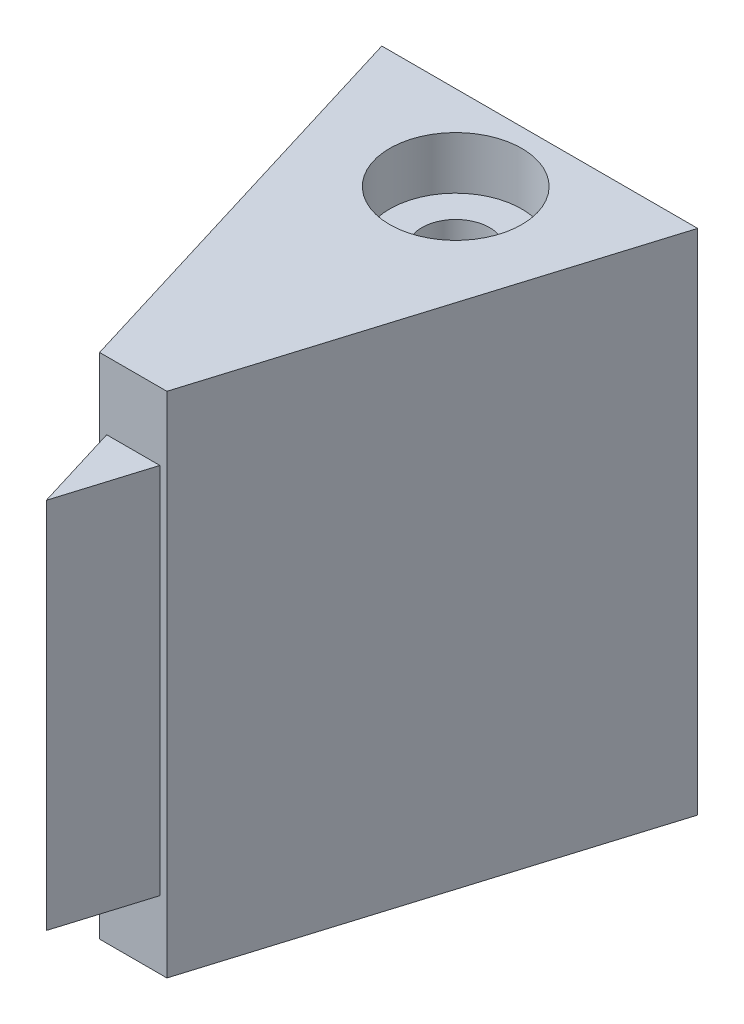
ISO-10303-21;
HEADER;
FILE_DESCRIPTION(('STEP AP214'),'2;1');
FILE_NAME('part.step','',(''),(''),'','','');
FILE_SCHEMA(('AUTOMOTIVE_DESIGN { 1 0 10303 214 1 1 1 1 }'));
ENDSEC;
DATA;
#1=APPLICATION_CONTEXT('core data for automotive mechanical design processes');
#2=APPLICATION_PROTOCOL_DEFINITION('international standard','automotive_design',2000,#1);
#3=PRODUCT_CONTEXT('',#1,'mechanical');
#4=PRODUCT('Part','Part','',(#3));
#5=PRODUCT_RELATED_PRODUCT_CATEGORY('part','',(#4));
#6=PRODUCT_DEFINITION_FORMATION('','',#4);
#7=PRODUCT_DEFINITION_CONTEXT('part definition',#1,'design');
#8=PRODUCT_DEFINITION('design','',#6,#7);
#9=PRODUCT_DEFINITION_SHAPE('','',#8);
#10=(LENGTH_UNIT() NAMED_UNIT(*) SI_UNIT(.MILLI.,.METRE.));
#11=(NAMED_UNIT(*) PLANE_ANGLE_UNIT() SI_UNIT($,.RADIAN.));
#12=(NAMED_UNIT(*) SI_UNIT($,.STERADIAN.) SOLID_ANGLE_UNIT());
#13=UNCERTAINTY_MEASURE_WITH_UNIT(LENGTH_MEASURE(1.E-05),#10,'distance_accuracy_value','');
#14=(GEOMETRIC_REPRESENTATION_CONTEXT(3) GLOBAL_UNCERTAINTY_ASSIGNED_CONTEXT((#13)) GLOBAL_UNIT_ASSIGNED_CONTEXT((#10,
#11,#12)) REPRESENTATION_CONTEXT('',''));
#15=CARTESIAN_POINT('',(0.,0.,0.));
#16=DIRECTION('',(0.,0.,1.));
#17=DIRECTION('',(1.,0.,0.));
#18=AXIS2_PLACEMENT_3D('',#15,#16,#17);
#19=CARTESIAN_POINT('',(-0.0200292878637935,-2.51,19.1313092850622));
#20=DIRECTION('',(0.956304755963033,0.,-0.292371704722745));
#21=DIRECTION('',(-0.292371704722745,0.,-0.956304755963033));
#22=AXIS2_PLACEMENT_3D('',#19,#20,#21);
#23=PLANE('',#22);
#24=DIRECTION('',(0.292371704722745,0.,0.956304755963033));
#25=VECTOR('',#24,1.);
#26=CARTESIAN_POINT('',(-5.36736335318274,-0.5,1.64096765560485));
#27=LINE('',#26,#25);
#28=CARTESIAN_POINT('',(-0.804515651307037,-0.5,16.5653700090289));
#29=VERTEX_POINT('',#28);
#30=CARTESIAN_POINT('',(-0.0200292878637974,-0.5,19.1313092850623));
#31=VERTEX_POINT('',#30);
#32=EDGE_CURVE('E126',#29,#31,#27,.T.);
#33=ORIENTED_EDGE('',*,*,#32,.T.);
#34=DIRECTION('',(0.,1.,0.));
#35=VECTOR('',#34,1.);
#36=CARTESIAN_POINT('',(-0.0200292878637935,-2.51,19.1313092850622));
#37=LINE('',#36,#35);
#38=CARTESIAN_POINT('',(-0.0200292878637948,10.5,19.1313092850622));
#39=VERTEX_POINT('',#38);
#40=EDGE_CURVE('E49',#31,#39,#37,.T.);
#41=ORIENTED_EDGE('',*,*,#40,.T.);
#42=DIRECTION('',(0.292371704722745,0.,0.956304755963033));
#43=VECTOR('',#42,1.);
#44=CARTESIAN_POINT('',(-0.0200292878637948,10.5,19.1313092850622));
#45=LINE('',#44,#43);
#46=CARTESIAN_POINT('',(-0.804515651307037,10.5,16.5653700090289));
#47=VERTEX_POINT('',#46);
#48=EDGE_CURVE('E304',#47,#39,#45,.T.);
#49=ORIENTED_EDGE('',*,*,#48,.F.);
#50=DIRECTION('',(0.,1.,0.));
#51=VECTOR('',#50,1.);
#52=CARTESIAN_POINT('',(-0.804515651307037,-2.51,16.5653700090289));
#53=LINE('',#52,#51);
#54=EDGE_CURVE('E11',#29,#47,#53,.T.);
#55=ORIENTED_EDGE('',*,*,#54,.F.);
#56=EDGE_LOOP('',(#33,#41,#49,#55));
#57=FACE_BOUND('',#56,.T.);
#58=ADVANCED_FACE('F40',(#57),#23,.F.);
#59=CARTESIAN_POINT('',(0.764457075579426,-2.51,16.5653700090289));
#60=DIRECTION('',(-0.956304755963036,0.,-0.292371704722737));
#61=DIRECTION('',(-0.292371704722737,0.,0.956304755963036));
#62=AXIS2_PLACEMENT_3D('',#59,#60,#61);
#63=PLANE('',#62);
#64=DIRECTION('',(0.292371704722738,0.,-0.956304755963035));
#65=VECTOR('',#64,1.);
#66=CARTESIAN_POINT('',(5.33072903312822,-0.5,1.62976741996976));
#67=LINE('',#66,#65);
#68=CARTESIAN_POINT('',(0.764457075579427,-0.5,16.5653700090289));
#69=VERTEX_POINT('',#68);
#70=EDGE_CURVE('E123',#31,#69,#67,.T.);
#71=ORIENTED_EDGE('',*,*,#70,.T.);
#72=DIRECTION('',(0.,1.,0.));
#73=VECTOR('',#72,1.);
#74=CARTESIAN_POINT('',(0.764457075579426,-2.51,16.5653700090289));
#75=LINE('',#74,#73);
#76=CARTESIAN_POINT('',(0.764457075579427,10.5,16.5653700090289));
#77=VERTEX_POINT('',#76);
#78=EDGE_CURVE('E141',#69,#77,#75,.T.);
#79=ORIENTED_EDGE('',*,*,#78,.T.);
#80=DIRECTION('',(0.292371704722738,0.,-0.956304755963035));
#81=VECTOR('',#80,1.);
#82=CARTESIAN_POINT('',(0.764457075579427,10.5,16.5653700090289));
#83=LINE('',#82,#81);
#84=EDGE_CURVE('E140',#39,#77,#83,.T.);
#85=ORIENTED_EDGE('',*,*,#84,.F.);
#86=ORIENTED_EDGE('',*,*,#40,.F.);
#87=EDGE_LOOP('',(#71,#79,#85,#86));
#88=FACE_BOUND('',#87,.T.);
#89=ADVANCED_FACE('F138',(#88),#63,.F.);
#90=CARTESIAN_POINT('',(0.,-2.5,0.));
#91=DIRECTION('',(0.,1.,0.));
#92=DIRECTION('',(0.,0.,1.));
#93=AXIS2_PLACEMENT_3D('',#90,#91,#92);
#94=PLANE('',#93);
#95=CARTESIAN_POINT('',(0.,-2.5,7.06537000902889));
#96=DIRECTION('',(0.,1.,0.));
#97=DIRECTION('',(0.,0.,1.));
#98=AXIS2_PLACEMENT_3D('',#95,#96,#97);
#99=CIRCLE('',#98,0.999999999999795);
#100=CARTESIAN_POINT('',(0.,-2.5,8.06537000902868));
#101=VERTEX_POINT('',#100);
#102=EDGE_CURVE('E152',#101,#101,#99,.T.);
#103=ORIENTED_EDGE('',*,*,#102,.T.);
#104=EDGE_LOOP('',(#103));
#105=FACE_BOUND('',#104,.T.);
#106=DIRECTION('',(0.292371704722737,0.,-0.956304755963035));
#107=VECTOR('',#106,1.);
#108=CARTESIAN_POINT('',(0.973595426876858,-2.5,16.5653700090289));
#109=LINE('',#108,#107);
#110=CARTESIAN_POINT('',(0.973595426876858,-2.5,16.5653700090289));
#111=VERTEX_POINT('',#110);
#112=CARTESIAN_POINT('',(4.64236360438078,-2.5,4.56537000902889));
#113=VERTEX_POINT('',#112);
#114=EDGE_CURVE('E166',#111,#113,#109,.T.);
#115=ORIENTED_EDGE('',*,*,#114,.F.);
#116=DIRECTION('',(-1.,0.,0.));
#117=VECTOR('',#116,1.);
#118=CARTESIAN_POINT('',(0.,-2.5,16.5653700090289));
#119=LINE('',#118,#117);
#120=CARTESIAN_POINT('',(-1.01365400260447,-2.5,16.5653700090289));
#121=VERTEX_POINT('',#120);
#122=EDGE_CURVE('E44',#111,#121,#119,.T.);
#123=ORIENTED_EDGE('',*,*,#122,.T.);
#124=DIRECTION('',(0.292371704722747,0.,0.956304755963032));
#125=VECTOR('',#124,1.);
#126=CARTESIAN_POINT('',(-0.0200292878637907,-2.5,19.8153700090289));
#127=LINE('',#126,#125);
#128=CARTESIAN_POINT('',(-4.68242218010851,-2.5,4.56537000902889));
#129=VERTEX_POINT('',#128);
#130=EDGE_CURVE('E168',#129,#121,#127,.T.);
#131=ORIENTED_EDGE('',*,*,#130,.F.);
#132=DIRECTION('',(-1.,0.,0.));
#133=VECTOR('',#132,1.);
#134=CARTESIAN_POINT('',(4.64236360438078,-2.5,4.56537000902889));
#135=LINE('',#134,#133);
#136=EDGE_CURVE('E162',#113,#129,#135,.T.);
#137=ORIENTED_EDGE('',*,*,#136,.F.);
#138=EDGE_LOOP('',(#115,#123,#131,#137));
#139=FACE_BOUND('',#138,.T.);
#140=ADVANCED_FACE('F272',(#105,#139),#94,.F.);
#141=CARTESIAN_POINT('',(0.973595426876855,-2.51,16.5653700090289));
#142=DIRECTION('',(0.,0.,-1.));
#143=DIRECTION('',(-1.,0.,0.));
#144=AXIS2_PLACEMENT_3D('',#141,#142,#143);
#145=PLANE('',#144);
#146=DIRECTION('',(-1.,0.,0.));
#147=VECTOR('',#146,1.);
#148=CARTESIAN_POINT('',(0.,-0.5,16.5653700090289));
#149=LINE('',#148,#147);
#150=EDGE_CURVE('E128',#69,#29,#149,.T.);
#151=ORIENTED_EDGE('',*,*,#150,.T.);
#152=ORIENTED_EDGE('',*,*,#54,.T.);
#153=DIRECTION('',(-1.,0.,0.));
#154=VECTOR('',#153,1.);
#155=CARTESIAN_POINT('',(-0.804515651307037,10.5,16.5653700090289));
#156=LINE('',#155,#154);
#157=EDGE_CURVE('E297',#77,#47,#156,.T.);
#158=ORIENTED_EDGE('',*,*,#157,.F.);
#159=ORIENTED_EDGE('',*,*,#78,.F.);
#160=EDGE_LOOP('',(#151,#152,#158,#159));
#161=FACE_BOUND('',#160,.T.);
#162=DIRECTION('',(0.,1.,0.));
#163=VECTOR('',#162,1.);
#164=CARTESIAN_POINT('',(0.973595426876858,-2.5,16.5653700090289));
#165=LINE('',#164,#163);
#166=CARTESIAN_POINT('',(0.973595426876858,12.5,16.5653700090289));
#167=VERTEX_POINT('',#166);
#168=EDGE_CURVE('E146',#111,#167,#165,.T.);
#169=ORIENTED_EDGE('',*,*,#168,.T.);
#170=DIRECTION('',(-1.,0.,0.));
#171=VECTOR('',#170,1.);
#172=CARTESIAN_POINT('',(0.,12.5,16.5653700090289));
#173=LINE('',#172,#171);
#174=CARTESIAN_POINT('',(-1.01365400260447,12.5,16.5653700090289));
#175=VERTEX_POINT('',#174);
#176=EDGE_CURVE('E57',#167,#175,#173,.T.);
#177=ORIENTED_EDGE('',*,*,#176,.T.);
#178=DIRECTION('',(0.,-1.,0.));
#179=VECTOR('',#178,1.);
#180=CARTESIAN_POINT('',(-1.01365400260447,-2.5,16.5653700090289));
#181=LINE('',#180,#179);
#182=EDGE_CURVE('E144',#175,#121,#181,.T.);
#183=ORIENTED_EDGE('',*,*,#182,.T.);
#184=ORIENTED_EDGE('',*,*,#122,.F.);
#185=EDGE_LOOP('',(#169,#177,#183,#184));
#186=FACE_BOUND('',#185,.T.);
#187=ADVANCED_FACE('F42',(#161,#186),#145,.F.);
#188=CARTESIAN_POINT('',(-0.0200292878638651,5.,9.56537000902889));
#189=DIRECTION('',(0.,0.,-1.));
#190=DIRECTION('',(-1.,0.,0.));
#191=AXIS2_PLACEMENT_3D('',#188,#189,#190);
#192=PLANE('',#191);
#193=CARTESIAN_POINT('',(-0.0200292878638651,5.,9.56537000902889));
#194=DIRECTION('',(0.,0.,-1.));
#195=DIRECTION('',(-1.,0.,0.));
#196=AXIS2_PLACEMENT_3D('',#193,#194,#195);
#197=CIRCLE('',#196,3.05);
#198=CARTESIAN_POINT('',(2.87824606137402,4.05,9.56537000902889));
#199=VERTEX_POINT('',#198);
#200=CARTESIAN_POINT('',(-2.91830463710175,4.05,9.56537000902889));
#201=VERTEX_POINT('',#200);
#202=EDGE_CURVE('E187',#199,#201,#197,.T.);
#203=ORIENTED_EDGE('',*,*,#202,.T.);
#204=DIRECTION('',(1.,0.,0.));
#205=VECTOR('',#204,1.);
#206=CARTESIAN_POINT('',(2.87824606137402,4.05,9.56537000902889));
#207=LINE('',#206,#205);
#208=EDGE_CURVE('E182',#201,#199,#207,.T.);
#209=ORIENTED_EDGE('',*,*,#208,.T.);
#210=EDGE_LOOP('',(#203,#209));
#211=FACE_BOUND('',#210,.T.);
#212=ADVANCED_FACE('F252',(#211),#192,.T.);
#213=CARTESIAN_POINT('',(0.,-2.5,7.06537000902889));
#214=DIRECTION('',(0.,1.,0.));
#215=DIRECTION('',(0.,0.,1.));
#216=AXIS2_PLACEMENT_3D('',#213,#214,#215);
#217=CYLINDRICAL_SURFACE('',#216,0.999999999999795);
#218=CARTESIAN_POINT('',(0.,5.95,7.06537000902889));
#219=DIRECTION('',(0.,-1.,0.));
#220=DIRECTION('',(0.,0.,-1.));
#221=AXIS2_PLACEMENT_3D('',#218,#219,#220);
#222=CIRCLE('',#221,0.999999999999795);
#223=CARTESIAN_POINT('',(0.,5.95,6.06537000902909));
#224=VERTEX_POINT('',#223);
#225=EDGE_CURVE('E154',#224,#224,#222,.T.);
#226=ORIENTED_EDGE('',*,*,#225,.F.);
#227=EDGE_LOOP('',(#226));
#228=FACE_BOUND('',#227,.T.);
#229=CARTESIAN_POINT('',(0.,4.05,7.06537000902889));
#230=DIRECTION('',(0.,1.,0.));
#231=DIRECTION('',(0.,0.,1.));
#232=AXIS2_PLACEMENT_3D('',#229,#230,#231);
#233=CIRCLE('',#232,0.999999999999795);
#234=CARTESIAN_POINT('',(0.,4.05,8.06537000902868));
#235=VERTEX_POINT('',#234);
#236=EDGE_CURVE('E218',#235,#235,#233,.T.);
#237=ORIENTED_EDGE('',*,*,#236,.F.);
#238=EDGE_LOOP('',(#237));
#239=FACE_BOUND('',#238,.T.);
#240=ADVANCED_FACE('F233',(#228,#239),#217,.F.);
#241=CARTESIAN_POINT('',(-0.0200292878638651,5.,9.56537000902889));
#242=DIRECTION('',(0.,0.,-1.));
#243=DIRECTION('',(-1.,0.,0.));
#244=AXIS2_PLACEMENT_3D('',#241,#242,#243);
#245=PLANE('',#244);
#246=CARTESIAN_POINT('',(-0.0200292878638651,5.,9.56537000902889));
#247=DIRECTION('',(0.,0.,-1.));
#248=DIRECTION('',(-1.,0.,0.));
#249=AXIS2_PLACEMENT_3D('',#246,#247,#248);
#250=CIRCLE('',#249,3.05);
#251=CARTESIAN_POINT('',(-2.91830463710175,5.95,9.56537000902889));
#252=VERTEX_POINT('',#251);
#253=CARTESIAN_POINT('',(2.87824606137402,5.95,9.56537000902889));
#254=VERTEX_POINT('',#253);
#255=EDGE_CURVE('E203',#252,#254,#250,.T.);
#256=ORIENTED_EDGE('',*,*,#255,.T.);
#257=DIRECTION('',(-1.,0.,0.));
#258=VECTOR('',#257,1.);
#259=CARTESIAN_POINT('',(2.87824606137402,5.95,9.56537000902889));
#260=LINE('',#259,#258);
#261=EDGE_CURVE('E198',#254,#252,#260,.T.);
#262=ORIENTED_EDGE('',*,*,#261,.T.);
#263=EDGE_LOOP('',(#256,#262));
#264=FACE_BOUND('',#263,.T.);
#265=ADVANCED_FACE('F236',(#264),#245,.T.);
#266=CARTESIAN_POINT('',(0.,8.04993423332826,8.06537000902868));
#267=CARTESIAN_POINT('',(0.0546821791008591,8.04957510796066,8.06537003134291));
#268=CARTESIAN_POINT('',(0.109354914126314,8.04773172784493,8.0608700796451));
#269=CARTESIAN_POINT('',(0.217072928600975,8.04124911512673,8.0430513451388));
#270=CARTESIAN_POINT('',(0.270117951898954,8.03660944482241,8.02973118167488));
#271=CARTESIAN_POINT('',(0.373013096085542,8.02501178523379,7.9947834956713));
#272=CARTESIAN_POINT('',(0.422868473539478,8.01805773388006,7.97317007466059));
#273=CARTESIAN_POINT('',(0.518239677542278,8.00251631313627,7.92231226129294));
#274=CARTESIAN_POINT('',(0.563754694999946,7.99392864011109,7.89306644995588));
#275=CARTESIAN_POINT('',(0.650728756928365,7.97567153728033,7.82670873711478));
#276=CARTESIAN_POINT('',(0.692016888170353,7.96597671144104,7.789379829442));
#277=CARTESIAN_POINT('',(0.767869116779319,7.94673554743408,7.7083762283634));
#278=CARTESIAN_POINT('',(0.802431776578928,7.93718924141278,7.66470018173609));
#279=CARTESIAN_POINT('',(0.864765151781457,7.91902793004534,7.5707826132558));
#280=CARTESIAN_POINT('',(0.892326299349008,7.91044519441132,7.52039518357941));
#281=CARTESIAN_POINT('',(0.938505856826815,7.89556616206647,7.41536260915563));
#282=CARTESIAN_POINT('',(0.957127077871142,7.88926914676962,7.36071880910146));
#283=CARTESIAN_POINT('',(0.984242433141647,7.87995461814357,7.25073786122397));
#284=CARTESIAN_POINT('',(0.993067689027361,7.87683020189835,7.19549165552765));
#285=CARTESIAN_POINT('',(1.00137637507627,7.87389140563375,7.0842210997125));
#286=CARTESIAN_POINT('',(1.00086267310011,7.87407600946129,7.02819699375629));
#287=CARTESIAN_POINT('',(0.99076096088365,7.87764266918273,6.91967266210838));
#288=CARTESIAN_POINT('',(0.981587657973599,7.88087859001705,6.86712821582431));
#289=CARTESIAN_POINT('',(0.955100149434765,7.8899509641507,6.76437204334019));
#290=CARTESIAN_POINT('',(0.937784973426303,7.89578772742408,6.71416059597993));
#291=CARTESIAN_POINT('',(0.895224866547381,7.90952145894585,6.61653210436769));
#292=CARTESIAN_POINT('',(0.869854126003332,7.91745075100137,6.56917464604347));
#293=CARTESIAN_POINT('',(0.811993742784764,7.93447527343163,6.47925869308694));
#294=CARTESIAN_POINT('',(0.779502046774439,7.94357083978839,6.43670158801433));
#295=CARTESIAN_POINT('',(0.706310455681535,7.96250407370069,6.35524458013623));
#296=CARTESIAN_POINT('',(0.665269123333407,7.97235562915799,6.31665408360598));
#297=CARTESIAN_POINT('',(0.57718349640282,7.99129803558887,6.24682351617368));
#298=CARTESIAN_POINT('',(0.530138584475256,8.00038880817212,6.21558420213093));
#299=CARTESIAN_POINT('',(0.430676287465459,8.01694054662288,6.16106484602444));
#300=CARTESIAN_POINT('',(0.378205748438876,8.0243825903494,6.13787563631923));
#301=CARTESIAN_POINT('',(0.269803272333861,8.03668686866806,6.10075330920549));
#302=CARTESIAN_POINT('',(0.213872509814023,8.04154997336318,6.08681706955583));
#303=CARTESIAN_POINT('',(0.102675980012124,8.04801791966975,6.06913107849329));
#304=CARTESIAN_POINT('',(0.0474822649655247,8.04975195790472,6.06497514173016));
#305=CARTESIAN_POINT('',(-0.0628415625782379,8.05019803748363,6.0658238541015));
#306=CARTESIAN_POINT('',(-0.11797168444029,8.04891060250071,6.07082691579136));
#307=CARTESIAN_POINT('',(-0.224905098860222,8.04356865345438,6.0895227717292));
#308=CARTESIAN_POINT('',(-0.27675855569376,8.03959688095123,6.10295488916953));
#309=CARTESIAN_POINT('',(-0.377465816854332,8.02940636298488,6.13781410513821));
#310=CARTESIAN_POINT('',(-0.426319262034692,8.02318734910412,6.15924215873627));
#311=CARTESIAN_POINT('',(-0.520961047176242,8.00897230857037,6.2100604659352));
#312=CARTESIAN_POINT('',(-0.566646489467878,8.0009368899842,6.2396309979426));
#313=CARTESIAN_POINT('',(-0.65254261544519,7.98401517307969,6.30568228657445));
#314=CARTESIAN_POINT('',(-0.692751707956591,7.97512862873551,6.34216504424128));
#315=CARTESIAN_POINT('',(-0.768368832186386,7.9570367257478,6.42287653863802));
#316=CARTESIAN_POINT('',(-0.803492685593696,7.94783427305369,6.46737277538544));
#317=CARTESIAN_POINT('',(-0.865812896971176,7.93056297373217,6.561814306128));
#318=CARTESIAN_POINT('',(-0.893009191170616,7.92249413622404,6.61175964395225));
#319=CARTESIAN_POINT('',(-0.938600028099442,7.908487452095,6.71573217026841));
#320=CARTESIAN_POINT('',(-0.957006080265417,7.90254682148472,6.76975391336835));
#321=CARTESIAN_POINT('',(-0.984385447206509,7.89356679235751,6.88036261430816));
#322=CARTESIAN_POINT('',(-0.993362642639482,7.89052620031194,6.93694850680402));
#323=CARTESIAN_POINT('',(-1.00133163032267,7.88782991758724,7.04818230585044));
#324=CARTESIAN_POINT('',(-1.00077845522218,7.8880199719282,7.10279422493158));
#325=CARTESIAN_POINT('',(-0.990816979227545,7.89138344959095,7.21110590212351));
#326=CARTESIAN_POINT('',(-0.981409159874996,7.89455671067717,7.26480570967594));
#327=CARTESIAN_POINT('',(-0.954326006544325,7.90340934975765,7.36885594585062));
#328=CARTESIAN_POINT('',(-0.936795159679116,7.9090448351629,7.41924801009586));
#329=CARTESIAN_POINT('',(-0.894078597598813,7.92216267155434,7.51641516301269));
#330=CARTESIAN_POINT('',(-0.868891247980455,7.92964541680364,7.56318947674054));
#331=CARTESIAN_POINT('',(-0.810369867509382,7.94598359665686,7.6538685388687));
#332=CARTESIAN_POINT('',(-0.776744477808668,7.95488269367938,7.69757735474066));
#333=CARTESIAN_POINT('',(-0.702796321419838,7.97283954400193,7.77888143930107));
#334=CARTESIAN_POINT('',(-0.662471761379352,7.98189733920272,7.81647506561977));
#335=CARTESIAN_POINT('',(-0.574566833244119,7.99951060425292,7.88580532807814));
#336=CARTESIAN_POINT('',(-0.526781666832324,8.00803733466461,7.91729045245042));
#337=CARTESIAN_POINT('',(-0.42631739774142,8.02324420992155,7.97174481231142));
#338=CARTESIAN_POINT('',(-0.373639825535698,8.02992492966523,7.99471669981805));
#339=CARTESIAN_POINT('',(-0.268082191246842,8.04033135878708,8.03027889077588));
#340=CARTESIAN_POINT('',(-0.215395649662781,8.0442075496374,8.0433995880839));
#341=CARTESIAN_POINT('',(-0.108469393021745,8.04918673358594,8.06094409709436));
#342=CARTESIAN_POINT('',(-0.0542300522364904,8.05029038935139,8.06536998689896));
#343=CARTESIAN_POINT('',(0.,8.04993423332826,8.06537000902868));
#344=B_SPLINE_CURVE_WITH_KNOTS('',3,(#266,#267,#268,#269,#270,#271,#272,#273,#274,#275,#276,
#277,#278,#279,#280,#281,#282,#283,#284,#285,#286,#287,#288,#289,#290,#291,#292,#293,#294,#295,
#296,#297,#298,#299,#300,#301,#302,#303,#304,#305,#306,#307,#308,#309,#310,#311,#312,#313,#314,
#315,#316,#317,#318,#319,#320,#321,#322,#323,#324,#325,#326,#327,#328,#329,#330,#331,#332,#333,
#334,#335,#336,#337,#338,#339,#340,#341,#342,#343),.UNSPECIFIED.,.T.,.F.,(4,2,2,2,2,2,2,2,2,2,2,
2,2,2,2,2,2,2,2,2,2,2,2,2,2,2,2,2,2,2,2,2,2,2,2,2,2,2,4),(0.,0.163850025249576,
0.327725704522648,0.491323962064708,0.654952656763252,0.823688007705309,0.992459386251062,
1.16580686426493,1.33909979790541,1.50633759959778,1.67352404581624,1.83308952664912,
1.99267402993055,2.15488479838887,2.31714240219587,2.48792062945066,2.65871643191758,
2.83138111770078,3.00398751137513,3.16928819199399,3.33456022528501,3.49495717905625,
3.65537329747941,3.81967478229688,3.98402390415546,4.15550728499603,4.32699204524211,
4.49825165341348,4.66944074819149,4.83247997411711,4.99551033400225,5.15574601024891,
5.31601591541804,5.48284858292629,5.64972598333098,5.8224532304353,5.99512662474744,
6.15766074540814,6.32015601487876),.UNSPECIFIED.);
#345=CARTESIAN_POINT('',(0.,8.04993423332826,8.06537000902868));
#346=VERTEX_POINT('',#345);
#347=EDGE_CURVE('E157',#346,#346,#344,.T.);
#348=ORIENTED_EDGE('',*,*,#347,.F.);
#349=EDGE_LOOP('',(#348));
#350=FACE_BOUND('',#349,.T.);
#351=CARTESIAN_POINT('',(0.,10.95,7.06537000902889));
#352=DIRECTION('',(0.,1.,0.));
#353=DIRECTION('',(0.,0.,1.));
#354=AXIS2_PLACEMENT_3D('',#351,#352,#353);
#355=CIRCLE('',#354,0.999999999999795);
#356=CARTESIAN_POINT('',(0.,10.95,8.06537000902868));
#357=VERTEX_POINT('',#356);
#358=EDGE_CURVE('E149',#357,#357,#355,.F.);
#359=ORIENTED_EDGE('',*,*,#358,.F.);
#360=EDGE_LOOP('',(#359));
#361=FACE_BOUND('',#360,.T.);
#362=ADVANCED_FACE('F232',(#350,#361),#217,.F.);
#363=CARTESIAN_POINT('',(0.,10.95,7.06537000902889));
#364=DIRECTION('',(0.,1.,0.));
#365=DIRECTION('',(0.,0.,1.));
#366=AXIS2_PLACEMENT_3D('',#363,#364,#365);
#367=PLANE('',#366);
#368=CARTESIAN_POINT('',(0.,10.95,7.06537000902889));
#369=DIRECTION('',(0.,1.,0.));
#370=DIRECTION('',(0.,0.,1.));
#371=AXIS2_PLACEMENT_3D('',#368,#369,#370);
#372=CIRCLE('',#371,1.95);
#373=CARTESIAN_POINT('',(0.,10.95,9.01537000902889));
#374=VERTEX_POINT('',#373);
#375=EDGE_CURVE('E153',#374,#374,#372,.T.);
#376=ORIENTED_EDGE('',*,*,#375,.T.);
#377=EDGE_LOOP('',(#376));
#378=FACE_BOUND('',#377,.T.);
#379=ORIENTED_EDGE('',*,*,#358,.T.);
#380=EDGE_LOOP('',(#379));
#381=FACE_BOUND('',#380,.T.);
#382=ADVANCED_FACE('F257',(#378,#381),#367,.T.);
#383=CARTESIAN_POINT('',(2.87824606137402,4.05,9.56537000902889));
#384=DIRECTION('',(0.,1.,0.));
#385=DIRECTION('',(0.,0.,1.));
#386=AXIS2_PLACEMENT_3D('',#383,#384,#385);
#387=PLANE('',#386);
#388=ORIENTED_EDGE('',*,*,#236,.T.);
#389=EDGE_LOOP('',(#388));
#390=FACE_BOUND('',#389,.T.);
#391=DIRECTION('',(1.,0.,0.));
#392=VECTOR('',#391,1.);
#393=CARTESIAN_POINT('',(2.87824606137402,4.05,4.56537000902889));
#394=LINE('',#393,#392);
#395=CARTESIAN_POINT('',(-2.91830463710175,4.05,4.56537000902889));
#396=VERTEX_POINT('',#395);
#397=CARTESIAN_POINT('',(2.87824606137402,4.05,4.56537000902889));
#398=VERTEX_POINT('',#397);
#399=EDGE_CURVE('E184',#396,#398,#394,.T.);
#400=ORIENTED_EDGE('',*,*,#399,.T.);
#401=DIRECTION('',(0.,0.,-1.));
#402=VECTOR('',#401,1.);
#403=CARTESIAN_POINT('',(2.87824606137402,4.05,9.56537000902889));
#404=LINE('',#403,#402);
#405=EDGE_CURVE('E178',#199,#398,#404,.T.);
#406=ORIENTED_EDGE('',*,*,#405,.F.);
#407=ORIENTED_EDGE('',*,*,#208,.F.);
#408=DIRECTION('',(0.,0.,-1.));
#409=VECTOR('',#408,1.);
#410=CARTESIAN_POINT('',(-2.91830463710175,4.05,9.56537000902889));
#411=LINE('',#410,#409);
#412=EDGE_CURVE('E179',#201,#396,#411,.T.);
#413=ORIENTED_EDGE('',*,*,#412,.T.);
#414=EDGE_LOOP('',(#400,#406,#407,#413));
#415=FACE_BOUND('',#414,.T.);
#416=ADVANCED_FACE('F255',(#390,#415),#387,.F.);
#417=CARTESIAN_POINT('',(-0.0200292878638651,5.,9.56537000902889));
#418=DIRECTION('',(0.,0.,-1.));
#419=DIRECTION('',(-1.,0.,0.));
#420=AXIS2_PLACEMENT_3D('',#417,#418,#419);
#421=CYLINDRICAL_SURFACE('',#420,3.05);
#422=CARTESIAN_POINT('',(0.,1.95006576667174,8.06537000902868));
#423=CARTESIAN_POINT('',(-0.0545467083170213,1.94970747285087,8.06537014842768));
#424=CARTESIAN_POINT('',(-0.109102594425875,1.95082617973328,8.0608924995377));
#425=CARTESIAN_POINT('',(-0.216630559947825,1.95586683343102,8.04314372343465));
#426=CARTESIAN_POINT('',(-0.269602455019722,1.95978910520613,8.02987157686885));
#427=CARTESIAN_POINT('',(-0.372395540865111,1.96998281568037,7.9950275098491));
#428=CARTESIAN_POINT('',(-0.422221565195225,1.97625054265354,7.973468701733));
#429=CARTESIAN_POINT('',(-0.517558158763021,1.99046661490332,7.92272142069787));
#430=CARTESIAN_POINT('',(-0.563067913976883,1.9984152762853,7.89353151248061));
#431=CARTESIAN_POINT('',(-0.649966255197754,2.0154231807719,7.82735020137387));
#432=CARTESIAN_POINT('',(-0.691194169171496,2.02450822082243,7.79015451043477));
#433=CARTESIAN_POINT('',(-0.766956256715783,2.04261595831002,7.7094526800914));
#434=CARTESIAN_POINT('',(-0.801489039696813,2.05163864242117,7.66594523299885));
#435=CARTESIAN_POINT('',(-0.863833114798163,2.06886144062743,7.57236170710818));
#436=CARTESIAN_POINT('',(-0.891427757355958,2.07703123807653,7.5221351619421));
#437=CARTESIAN_POINT('',(-0.937715224095409,2.09122999962885,7.41745339240553));
#438=CARTESIAN_POINT('',(-0.956410489644233,2.09725955075052,7.36299933254285));
#439=CARTESIAN_POINT('',(-0.98378774157987,2.10623552314352,7.25316209699885));
#440=CARTESIAN_POINT('',(-0.992758921547917,2.10927073194073,7.19785848159756));
#441=CARTESIAN_POINT('',(-1.00133622536939,2.1121705310223,7.08645414512163));
#442=CARTESIAN_POINT('',(-1.00094504098822,2.11203603262665,7.03035365779079));
#443=CARTESIAN_POINT('',(-0.991038308718468,2.10869152283109,6.92147912268892));
#444=CARTESIAN_POINT('',(-0.981911130689609,2.10561242249054,6.86866501351363));
#445=CARTESIAN_POINT('',(-0.955426185023448,2.09694560803578,6.76536168143749));
#446=CARTESIAN_POINT('',(-0.938067486579282,2.09135761022334,6.71487272216934));
#447=CARTESIAN_POINT('',(-0.895355477528405,2.07821837470153,6.6167672431692));
#448=CARTESIAN_POINT('',(-0.869886126954097,2.07063893932841,6.5692051855977));
#449=CARTESIAN_POINT('',(-0.811753224255465,2.05439616233121,6.47890419675966));
#450=CARTESIAN_POINT('',(-0.779087700884409,2.04573252399295,6.43616659191586));
#451=CARTESIAN_POINT('',(-0.705621370189618,2.02780243830253,6.35455640683283));
#452=CARTESIAN_POINT('',(-0.664503649472307,2.01852709526581,6.31597050530051));
#453=CARTESIAN_POINT('',(-0.57625917050636,2.00081162712214,6.24616898216816));
#454=CARTESIAN_POINT('',(-0.529131951252226,1.99237156618035,6.21495392653086));
#455=CARTESIAN_POINT('',(-0.42967631027486,1.97721392807559,6.16059752963539));
#456=CARTESIAN_POINT('',(-0.377310405391615,1.97051020892516,6.13752064297751));
#457=CARTESIAN_POINT('',(-0.269171299120882,1.9597079998363,6.10058591678685));
#458=CARTESIAN_POINT('',(-0.213399241292621,1.95560864074058,6.08672500152104));
#459=CARTESIAN_POINT('',(-0.10253908456766,1.95063259271298,6.06912548318687));
#460=CARTESIAN_POINT('',(-0.0475199824239522,1.94962825812152,6.06498767267624));
#461=CARTESIAN_POINT('',(0.0624178408306011,1.95061930503421,6.06580783262257));
#462=CARTESIAN_POINT('',(0.117336575934049,1.95261423039507,6.07076441998072));
#463=CARTESIAN_POINT('',(0.224019697915292,1.95932166494474,6.08932142334608));
#464=CARTESIAN_POINT('',(0.275829029613629,1.96396161104079,6.10269199072763));
#465=CARTESIAN_POINT('',(0.376441018754687,1.97545416982598,6.1374016340776));
#466=CARTESIAN_POINT('',(0.425243272951458,1.98230707850544,6.15874177606015));
#467=CARTESIAN_POINT('',(0.519942958677845,1.99778474493448,6.20943615236094));
#468=CARTESIAN_POINT('',(0.565724086676077,2.00645292462781,6.23899404054972));
#469=CARTESIAN_POINT('',(0.65180500165392,2.02458793082162,6.30504407730197));
#470=CARTESIAN_POINT('',(0.692103118494657,2.03405499924922,6.34153833062207));
#471=CARTESIAN_POINT('',(0.767932225486806,2.05327037108428,6.42234306540777));
#472=CARTESIAN_POINT('',(0.803172677487142,2.06301253612594,6.46692833440378));
#473=CARTESIAN_POINT('',(0.865699423276716,2.08125899142385,6.5616021249502));
#474=CARTESIAN_POINT('',(0.892985766856479,2.08976328942864,6.61169061204926));
#475=CARTESIAN_POINT('',(0.938651779165637,2.10448494111707,6.71586576519746));
#476=CARTESIAN_POINT('',(0.957065998669795,2.11071114322027,6.76993596046547));
#477=CARTESIAN_POINT('',(0.984445615434366,2.12011390689645,6.88066589489971));
#478=CARTESIAN_POINT('',(0.993415282022461,2.12329184635206,6.93732445192374));
#479=CARTESIAN_POINT('',(1.00132679388868,2.12609197133263,7.04845788777591));
#480=CARTESIAN_POINT('',(1.00076507768828,2.12589019545742,7.10289342027352));
#481=CARTESIAN_POINT('',(0.990844746741187,2.12238627741313,7.21085016959212));
#482=CARTESIAN_POINT('',(0.981486635847406,2.11908431282127,7.26437143860285));
#483=CARTESIAN_POINT('',(0.954582416471499,2.1098742046831,7.36800345557402));
#484=CARTESIAN_POINT('',(0.937190144831295,2.10401513574912,7.41815883854906));
#485=CARTESIAN_POINT('',(0.894835988822796,2.090358382842,7.51487803621554));
#486=CARTESIAN_POINT('',(0.869872431323104,2.08256027044038,7.56144105419678));
#487=CARTESIAN_POINT('',(0.811804845722808,2.06546338643234,7.65187315687851));
#488=CARTESIAN_POINT('',(0.778391036585527,2.05611369258926,7.69553364274029));
#489=CARTESIAN_POINT('',(0.704904242322278,2.03716191630836,7.77678571189248));
#490=CARTESIAN_POINT('',(0.664829330890099,2.02755976154021,7.81437553340602));
#491=CARTESIAN_POINT('',(0.577262492650444,2.0087087644859,7.88391432033876));
#492=CARTESIAN_POINT('',(0.529540250451134,1.99948882586492,7.91558208528871));
#493=CARTESIAN_POINT('',(0.42915302715261,1.98282933317401,7.97040925400301));
#494=CARTESIAN_POINT('',(0.376489408870778,1.97538929021161,7.99357099509525));
#495=CARTESIAN_POINT('',(0.270526055479718,1.96342787080536,8.02962243255354));
#496=CARTESIAN_POINT('',(0.21740168051063,1.95877488381879,8.04298349104672));
#497=CARTESIAN_POINT('',(0.109520989825704,1.95227407622703,8.06085600970638));
#498=CARTESIAN_POINT('',(0.0547651206314484,1.95042549514897,8.06536986907151));
#499=CARTESIAN_POINT('',(0.,1.95006576667174,8.06537000902868));
#500=B_SPLINE_CURVE_WITH_KNOTS('',3,(#422,#423,#424,#425,#426,#427,#428,#429,#430,#431,#432,
#433,#434,#435,#436,#437,#438,#439,#440,#441,#442,#443,#444,#445,#446,#447,#448,#449,#450,#451,
#452,#453,#454,#455,#456,#457,#458,#459,#460,#461,#462,#463,#464,#465,#466,#467,#468,#469,#470,
#471,#472,#473,#474,#475,#476,#477,#478,#479,#480,#481,#482,#483,#484,#485,#486,#487,#488,#489,
#490,#491,#492,#493,#494,#495,#496,#497,#498,#499),.UNSPECIFIED.,.T.,.F.,(4,2,2,2,2,2,2,2,2,2,2,
2,2,2,2,2,2,2,2,2,2,2,2,2,2,2,2,2,2,2,2,2,2,2,2,2,2,2,4),(0.,0.163442738145022,
0.326904423927134,0.490108515076376,0.653343324638449,0.821381387841708,0.989454315519196,
1.16225995148931,1.33501815430968,1.50248425360626,1.66990220544567,1.83020712775361,
1.99053018140408,2.15325864915569,2.31603174864767,2.48667281288232,2.65732697535582,
2.82930387628821,3.00122335289978,3.16595058911983,3.33065277528572,3.49104017270917,
3.65144903131624,3.81625518004188,3.98111141728132,4.15327611944035,4.32543974387269,
4.49692737970757,4.66833746273024,4.83084843459238,4.993350098478,5.15286155264116,
5.31240828196405,5.4789731824826,5.64558633552872,5.81877562096729,5.9919172809142,
6.15605898403024,6.32015616875538),.UNSPECIFIED.);
#501=CARTESIAN_POINT('',(0.,1.95006576667174,8.06537000902868));
#502=VERTEX_POINT('',#501);
#503=EDGE_CURVE('E206',#502,#502,#500,.T.);
#504=ORIENTED_EDGE('',*,*,#503,.T.);
#505=EDGE_LOOP('',(#504));
#506=FACE_BOUND('',#505,.T.);
#507=CARTESIAN_POINT('',(-0.0200292878638651,5.,4.56537000902889));
#508=DIRECTION('',(0.,0.,-1.));
#509=DIRECTION('',(-1.,0.,0.));
#510=AXIS2_PLACEMENT_3D('',#507,#508,#509);
#511=CIRCLE('',#510,3.05);
#512=EDGE_CURVE('E188',#398,#396,#511,.T.);
#513=ORIENTED_EDGE('',*,*,#512,.T.);
#514=ORIENTED_EDGE('',*,*,#412,.F.);
#515=ORIENTED_EDGE('',*,*,#202,.F.);
#516=ORIENTED_EDGE('',*,*,#405,.T.);
#517=EDGE_LOOP('',(#513,#514,#515,#516));
#518=FACE_BOUND('',#517,.T.);
#519=ADVANCED_FACE('F220',(#506,#518),#421,.F.);
#520=CARTESIAN_POINT('',(2.87824606137402,5.95,9.56537000902889));
#521=DIRECTION('',(0.,-1.,0.));
#522=DIRECTION('',(0.,0.,-1.));
#523=AXIS2_PLACEMENT_3D('',#520,#521,#522);
#524=PLANE('',#523);
#525=ORIENTED_EDGE('',*,*,#225,.T.);
#526=EDGE_LOOP('',(#525));
#527=FACE_BOUND('',#526,.T.);
#528=DIRECTION('',(-1.,0.,0.));
#529=VECTOR('',#528,1.);
#530=CARTESIAN_POINT('',(2.87824606137402,5.95,4.56537000902889));
#531=LINE('',#530,#529);
#532=CARTESIAN_POINT('',(2.87824606137402,5.95,4.56537000902889));
#533=VERTEX_POINT('',#532);
#534=CARTESIAN_POINT('',(-2.91830463710175,5.95,4.56537000902889));
#535=VERTEX_POINT('',#534);
#536=EDGE_CURVE('E200',#533,#535,#531,.T.);
#537=ORIENTED_EDGE('',*,*,#536,.T.);
#538=DIRECTION('',(0.,0.,-1.));
#539=VECTOR('',#538,1.);
#540=CARTESIAN_POINT('',(-2.91830463710175,5.95,9.56537000902889));
#541=LINE('',#540,#539);
#542=EDGE_CURVE('E190',#252,#535,#541,.T.);
#543=ORIENTED_EDGE('',*,*,#542,.F.);
#544=ORIENTED_EDGE('',*,*,#261,.F.);
#545=DIRECTION('',(0.,0.,-1.));
#546=VECTOR('',#545,1.);
#547=CARTESIAN_POINT('',(2.87824606137402,5.95,9.56537000902889));
#548=LINE('',#547,#546);
#549=EDGE_CURVE('E195',#254,#533,#548,.T.);
#550=ORIENTED_EDGE('',*,*,#549,.T.);
#551=EDGE_LOOP('',(#537,#543,#544,#550));
#552=FACE_BOUND('',#551,.T.);
#553=ADVANCED_FACE('F250',(#527,#552),#524,.F.);
#554=CARTESIAN_POINT('',(-0.0200292878638651,5.,9.56537000902889));
#555=DIRECTION('',(0.,0.,-1.));
#556=DIRECTION('',(-1.,0.,0.));
#557=AXIS2_PLACEMENT_3D('',#554,#555,#556);
#558=CYLINDRICAL_SURFACE('',#557,3.05);
#559=ORIENTED_EDGE('',*,*,#347,.T.);
#560=EDGE_LOOP('',(#559));
#561=FACE_BOUND('',#560,.T.);
#562=CARTESIAN_POINT('',(-0.0200292878638651,5.,4.56537000902889));
#563=DIRECTION('',(0.,0.,-1.));
#564=DIRECTION('',(-1.,0.,0.));
#565=AXIS2_PLACEMENT_3D('',#562,#563,#564);
#566=CIRCLE('',#565,3.05);
#567=EDGE_CURVE('E204',#535,#533,#566,.T.);
#568=ORIENTED_EDGE('',*,*,#567,.T.);
#569=ORIENTED_EDGE('',*,*,#549,.F.);
#570=ORIENTED_EDGE('',*,*,#255,.F.);
#571=ORIENTED_EDGE('',*,*,#542,.T.);
#572=EDGE_LOOP('',(#568,#569,#570,#571));
#573=FACE_BOUND('',#572,.T.);
#574=ADVANCED_FACE('F246',(#561,#573),#558,.F.);
#575=CARTESIAN_POINT('',(0.,10.95,7.06537000902889));
#576=DIRECTION('',(0.,1.,0.));
#577=DIRECTION('',(0.,0.,1.));
#578=AXIS2_PLACEMENT_3D('',#575,#576,#577);
#579=CYLINDRICAL_SURFACE('',#578,1.95);
#580=CARTESIAN_POINT('',(0.,12.5,7.06537000902889));
#581=DIRECTION('',(0.,1.,0.));
#582=DIRECTION('',(0.,0.,1.));
#583=AXIS2_PLACEMENT_3D('',#580,#581,#582);
#584=CIRCLE('',#583,1.95);
#585=CARTESIAN_POINT('',(0.,12.5,9.01537000902889));
#586=VERTEX_POINT('',#585);
#587=EDGE_CURVE('E295',#586,#586,#584,.T.);
#588=CARTESIAN_POINT('',(0.,10.95,9.01537000902889));
#589=CARTESIAN_POINT('',(0.,10.9661458333333,9.01537000902889));
#590=CARTESIAN_POINT('',(0.,10.9822916666667,9.01537000902889));
#591=CARTESIAN_POINT('',(0.,11.0145833333333,9.01537000902889));
#592=CARTESIAN_POINT('',(0.,11.0307291666667,9.01537000902889));
#593=CARTESIAN_POINT('',(0.,11.0630208333333,9.01537000902889));
#594=CARTESIAN_POINT('',(0.,11.0791666666667,9.01537000902889));
#595=CARTESIAN_POINT('',(0.,11.1114583333333,9.01537000902889));
#596=CARTESIAN_POINT('',(0.,11.1276041666667,9.01537000902889));
#597=CARTESIAN_POINT('',(0.,11.1598958333333,9.01537000902889));
#598=CARTESIAN_POINT('',(0.,11.1760416666667,9.01537000902889));
#599=CARTESIAN_POINT('',(0.,11.2083333333333,9.01537000902889));
#600=CARTESIAN_POINT('',(0.,11.2244791666667,9.01537000902889));
#601=CARTESIAN_POINT('',(0.,11.2567708333333,9.01537000902889));
#602=CARTESIAN_POINT('',(0.,11.2729166666667,9.01537000902889));
#603=CARTESIAN_POINT('',(0.,11.3052083333333,9.01537000902889));
#604=CARTESIAN_POINT('',(0.,11.3213541666667,9.01537000902889));
#605=CARTESIAN_POINT('',(0.,11.3536458333333,9.01537000902889));
#606=CARTESIAN_POINT('',(0.,11.3697916666667,9.01537000902889));
#607=CARTESIAN_POINT('',(0.,11.4020833333333,9.01537000902889));
#608=CARTESIAN_POINT('',(0.,11.4182291666667,9.01537000902889));
#609=CARTESIAN_POINT('',(0.,11.4505208333333,9.01537000902889));
#610=CARTESIAN_POINT('',(0.,11.4666666666667,9.01537000902889));
#611=CARTESIAN_POINT('',(0.,11.4989583333333,9.01537000902889));
#612=CARTESIAN_POINT('',(0.,11.5151041666667,9.01537000902889));
#613=CARTESIAN_POINT('',(0.,11.5473958333333,9.01537000902889));
#614=CARTESIAN_POINT('',(0.,11.5635416666667,9.01537000902889));
#615=CARTESIAN_POINT('',(0.,11.5958333333333,9.01537000902889));
#616=CARTESIAN_POINT('',(0.,11.6119791666667,9.01537000902889));
#617=CARTESIAN_POINT('',(0.,11.6442708333333,9.01537000902889));
#618=CARTESIAN_POINT('',(0.,11.6604166666667,9.01537000902889));
#619=CARTESIAN_POINT('',(0.,11.6927083333333,9.01537000902889));
#620=CARTESIAN_POINT('',(0.,11.7088541666667,9.01537000902889));
#621=CARTESIAN_POINT('',(0.,11.7411458333333,9.01537000902889));
#622=CARTESIAN_POINT('',(0.,11.7572916666667,9.01537000902889));
#623=CARTESIAN_POINT('',(0.,11.7895833333333,9.01537000902889));
#624=CARTESIAN_POINT('',(0.,11.8057291666667,9.01537000902889));
#625=CARTESIAN_POINT('',(0.,11.8380208333333,9.01537000902889));
#626=CARTESIAN_POINT('',(0.,11.8541666666667,9.01537000902889));
#627=CARTESIAN_POINT('',(0.,11.8864583333333,9.01537000902889));
#628=CARTESIAN_POINT('',(0.,11.9026041666667,9.01537000902889));
#629=CARTESIAN_POINT('',(0.,11.9348958333333,9.01537000902889));
#630=CARTESIAN_POINT('',(0.,11.9510416666667,9.01537000902889));
#631=CARTESIAN_POINT('',(0.,11.9833333333333,9.01537000902889));
#632=CARTESIAN_POINT('',(0.,11.9994791666667,9.01537000902889));
#633=CARTESIAN_POINT('',(0.,12.0317708333333,9.01537000902889));
#634=CARTESIAN_POINT('',(0.,12.0479166666667,9.01537000902889));
#635=CARTESIAN_POINT('',(0.,12.0802083333333,9.01537000902889));
#636=CARTESIAN_POINT('',(0.,12.0963541666667,9.01537000902889));
#637=CARTESIAN_POINT('',(0.,12.1286458333333,9.01537000902889));
#638=CARTESIAN_POINT('',(0.,12.1447916666667,9.01537000902889));
#639=CARTESIAN_POINT('',(0.,12.1770833333333,9.01537000902889));
#640=CARTESIAN_POINT('',(0.,12.1932291666667,9.01537000902889));
#641=CARTESIAN_POINT('',(0.,12.2255208333333,9.01537000902889));
#642=CARTESIAN_POINT('',(0.,12.2416666666667,9.01537000902889));
#643=CARTESIAN_POINT('',(0.,12.2739583333333,9.01537000902889));
#644=CARTESIAN_POINT('',(0.,12.2901041666667,9.01537000902889));
#645=CARTESIAN_POINT('',(0.,12.3223958333333,9.01537000902889));
#646=CARTESIAN_POINT('',(0.,12.3385416666667,9.01537000902889));
#647=CARTESIAN_POINT('',(0.,12.3708333333333,9.01537000902889));
#648=CARTESIAN_POINT('',(0.,12.3869791666667,9.01537000902889));
#649=CARTESIAN_POINT('',(0.,12.4192708333333,9.01537000902889));
#650=CARTESIAN_POINT('',(0.,12.4354166666667,9.01537000902889));
#651=CARTESIAN_POINT('',(0.,12.4677083333333,9.01537000902889));
#652=CARTESIAN_POINT('',(0.,12.4838541666667,9.01537000902889));
#653=CARTESIAN_POINT('',(0.,12.5,9.01537000902889));
#654=B_SPLINE_CURVE_WITH_KNOTS('',3,(#588,#589,#590,#591,#592,#593,#594,#595,#596,#597,#598,
#599,#600,#601,#602,#603,#604,#605,#606,#607,#608,#609,#610,#611,#612,#613,#614,#615,#616,#617,
#618,#619,#620,#621,#622,#623,#624,#625,#626,#627,#628,#629,#630,#631,#632,#633,#634,#635,#636,
#637,#638,#639,#640,#641,#642,#643,#644,#645,#646,#647,#648,#649,#650,#651,#652,#653),
.UNSPECIFIED.,.F.,.F.,(4,2,2,2,2,2,2,2,2,2,2,2,2,2,2,2,2,2,2,2,2,2,2,2,2,2,2,2,2,2,2,2,4),(0.,
0.0484375000000016,0.0968750000000015,0.145312500000001,0.193750000000001,0.242187500000001,
0.290625000000001,0.339062500000001,0.387500000000001,0.435937500000001,0.484375,0.5328125,
0.58125,0.6296875,0.678125,0.7265625,0.775,0.823437500000001,0.871875000000001,
0.920312500000001,0.968750000000001,1.0171875,1.065625,1.1140625,1.1625,1.2109375,1.259375,
1.3078125,1.35625,1.4046875,1.453125,1.5015625,1.55),.UNSPECIFIED.);
#655=EDGE_CURVE('BSEAM234',#374,#586,#654,.T.);
#656=ORIENTED_EDGE('',*,*,#375,.F.);
#657=ORIENTED_EDGE('',*,*,#587,.T.);
#658=ORIENTED_EDGE('',*,*,#655,.T.);
#659=ORIENTED_EDGE('',*,*,#655,.F.);
#660=EDGE_LOOP('',(#656,#658,#657,#659));
#661=FACE_BOUND('',#660,.T.);
#662=ADVANCED_FACE('F234',(#661),#579,.F.);
#663=CARTESIAN_POINT('',(-1.01365400260447,-2.5,16.5653700090289));
#664=DIRECTION('',(-0.956304755963033,0.,0.292371704722745));
#665=DIRECTION('',(0.292371704722745,0.,0.956304755963033));
#666=AXIS2_PLACEMENT_3D('',#663,#664,#665);
#667=PLANE('',#666);
#668=ORIENTED_EDGE('',*,*,#182,.F.);
#669=DIRECTION('',(0.292371704722747,0.,0.956304755963032));
#670=VECTOR('',#669,1.);
#671=CARTESIAN_POINT('',(-0.0200292878637907,12.5,19.8153700090289));
#672=LINE('',#671,#670);
#673=CARTESIAN_POINT('',(-4.68242218010851,12.5,4.56537000902889));
#674=VERTEX_POINT('',#673);
#675=EDGE_CURVE('E176',#674,#175,#672,.T.);
#676=ORIENTED_EDGE('',*,*,#675,.F.);
#677=DIRECTION('',(0.,1.,0.));
#678=VECTOR('',#677,1.);
#679=CARTESIAN_POINT('',(-4.68242218010851,-2.5,4.56537000902889));
#680=LINE('',#679,#678);
#681=EDGE_CURVE('E161',#129,#674,#680,.T.);
#682=ORIENTED_EDGE('',*,*,#681,.F.);
#683=ORIENTED_EDGE('',*,*,#130,.T.);
#684=EDGE_LOOP('',(#668,#676,#682,#683));
#685=FACE_BOUND('',#684,.T.);
#686=ADVANCED_FACE('F281',(#685),#667,.T.);
#687=CARTESIAN_POINT('',(4.64236360438078,-2.5,4.56537000902889));
#688=DIRECTION('',(0.,0.,-1.));
#689=DIRECTION('',(-1.,0.,0.));
#690=AXIS2_PLACEMENT_3D('',#687,#688,#689);
#691=PLANE('',#690);
#692=ORIENTED_EDGE('',*,*,#567,.F.);
#693=ORIENTED_EDGE('',*,*,#536,.F.);
#694=EDGE_LOOP('',(#692,#693));
#695=FACE_BOUND('',#694,.T.);
#696=ORIENTED_EDGE('',*,*,#512,.F.);
#697=ORIENTED_EDGE('',*,*,#399,.F.);
#698=EDGE_LOOP('',(#696,#697));
#699=FACE_BOUND('',#698,.T.);
#700=ORIENTED_EDGE('',*,*,#681,.T.);
#701=DIRECTION('',(-1.,0.,0.));
#702=VECTOR('',#701,1.);
#703=CARTESIAN_POINT('',(4.64236360438078,12.5,4.56537000902889));
#704=LINE('',#703,#702);
#705=CARTESIAN_POINT('',(4.64236360438078,12.5,4.56537000902889));
#706=VERTEX_POINT('',#705);
#707=EDGE_CURVE('E171',#706,#674,#704,.T.);
#708=ORIENTED_EDGE('',*,*,#707,.F.);
#709=DIRECTION('',(0.,1.,0.));
#710=VECTOR('',#709,1.);
#711=CARTESIAN_POINT('',(4.64236360438078,-2.5,4.56537000902889));
#712=LINE('',#711,#710);
#713=EDGE_CURVE('E158',#113,#706,#712,.T.);
#714=ORIENTED_EDGE('',*,*,#713,.F.);
#715=ORIENTED_EDGE('',*,*,#136,.T.);
#716=EDGE_LOOP('',(#700,#708,#714,#715));
#717=FACE_BOUND('',#716,.T.);
#718=ADVANCED_FACE('F277',(#695,#699,#717),#691,.T.);
#719=CARTESIAN_POINT('',(0.973595426876858,-2.5,16.5653700090289));
#720=DIRECTION('',(0.956304755963036,0.,0.292371704722736));
#721=DIRECTION('',(0.292371704722736,0.,-0.956304755963036));
#722=AXIS2_PLACEMENT_3D('',#719,#720,#721);
#723=PLANE('',#722);
#724=ORIENTED_EDGE('',*,*,#168,.F.);
#725=ORIENTED_EDGE('',*,*,#114,.T.);
#726=ORIENTED_EDGE('',*,*,#713,.T.);
#727=DIRECTION('',(0.292371704722737,0.,-0.956304755963035));
#728=VECTOR('',#727,1.);
#729=CARTESIAN_POINT('',(0.973595426876858,12.5,16.5653700090289));
#730=LINE('',#729,#728);
#731=EDGE_CURVE('E174',#167,#706,#730,.T.);
#732=ORIENTED_EDGE('',*,*,#731,.F.);
#733=EDGE_LOOP('',(#724,#725,#726,#732));
#734=FACE_BOUND('',#733,.T.);
#735=ADVANCED_FACE('F274',(#734),#723,.T.);
#736=CARTESIAN_POINT('',(0.,12.5,0.));
#737=DIRECTION('',(0.,1.,0.));
#738=DIRECTION('',(0.,0.,1.));
#739=AXIS2_PLACEMENT_3D('',#736,#737,#738);
#740=PLANE('',#739);
#741=ORIENTED_EDGE('',*,*,#675,.T.);
#742=ORIENTED_EDGE('',*,*,#176,.F.);
#743=ORIENTED_EDGE('',*,*,#731,.T.);
#744=ORIENTED_EDGE('',*,*,#707,.T.);
#745=EDGE_LOOP('',(#741,#742,#743,#744));
#746=FACE_BOUND('',#745,.T.);
#747=ORIENTED_EDGE('',*,*,#587,.F.);
#748=EDGE_LOOP('',(#747));
#749=FACE_BOUND('',#748,.T.);
#750=ADVANCED_FACE('F230',(#746,#749),#740,.T.);
#751=ORIENTED_EDGE('',*,*,#102,.F.);
#752=EDGE_LOOP('',(#751));
#753=FACE_BOUND('',#752,.T.);
#754=ORIENTED_EDGE('',*,*,#503,.F.);
#755=EDGE_LOOP('',(#754));
#756=FACE_BOUND('',#755,.T.);
#757=ADVANCED_FACE('F224',(#753,#756),#217,.F.);
#758=CARTESIAN_POINT('',(0.,10.5,0.));
#759=DIRECTION('',(0.,-1.,0.));
#760=DIRECTION('',(0.,0.,-1.));
#761=AXIS2_PLACEMENT_3D('',#758,#759,#760);
#762=PLANE('',#761);
#763=ORIENTED_EDGE('',*,*,#48,.T.);
#764=ORIENTED_EDGE('',*,*,#84,.T.);
#765=ORIENTED_EDGE('',*,*,#157,.T.);
#766=EDGE_LOOP('',(#763,#764,#765));
#767=FACE_BOUND('',#766,.T.);
#768=ADVANCED_FACE('F229',(#767),#762,.F.);
#769=CARTESIAN_POINT('',(0.,-0.5,0.));
#770=DIRECTION('',(0.,-1.,0.));
#771=DIRECTION('',(0.,0.,-1.));
#772=AXIS2_PLACEMENT_3D('',#769,#770,#771);
#773=PLANE('',#772);
#774=ORIENTED_EDGE('',*,*,#32,.F.);
#775=ORIENTED_EDGE('',*,*,#150,.F.);
#776=ORIENTED_EDGE('',*,*,#70,.F.);
#777=EDGE_LOOP('',(#774,#775,#776));
#778=FACE_BOUND('',#777,.T.);
#779=ADVANCED_FACE('F125',(#778),#773,.T.);
#780=CLOSED_SHELL('',(#58,#89,#140,#187,#212,#240,#265,#362,#382,#416,#519,#553,#574,#662,#686,
#718,#735,#750,#757,#768,#779));
#781=MANIFOLD_SOLID_BREP('B2',#780);
#782=ADVANCED_BREP_SHAPE_REPRESENTATION('',(#18,#781),#14);
#783=SHAPE_DEFINITION_REPRESENTATION(#9,#782);
ENDSEC;
END-ISO-10303-21;
